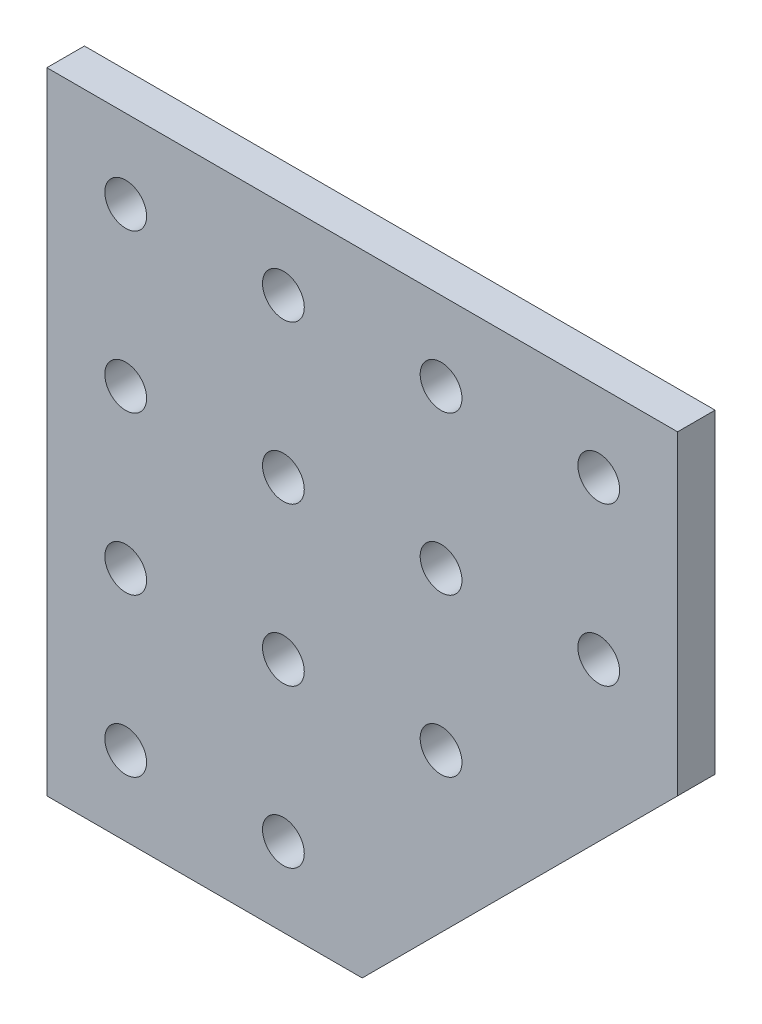
ISO-10303-21;
HEADER;
FILE_DESCRIPTION(('STEP AP214'),'2;1');
FILE_NAME('part.step','',(''),(''),'','','');
FILE_SCHEMA(('AUTOMOTIVE_DESIGN { 1 0 10303 214 1 1 1 1 }'));
ENDSEC;
DATA;
#1=APPLICATION_CONTEXT('core data for automotive mechanical design processes');
#2=APPLICATION_PROTOCOL_DEFINITION('international standard','automotive_design',2000,#1);
#3=PRODUCT_CONTEXT('',#1,'mechanical');
#4=PRODUCT('Part','Part','',(#3));
#5=PRODUCT_RELATED_PRODUCT_CATEGORY('part','',(#4));
#6=PRODUCT_DEFINITION_FORMATION('','',#4);
#7=PRODUCT_DEFINITION_CONTEXT('part definition',#1,'design');
#8=PRODUCT_DEFINITION('design','',#6,#7);
#9=PRODUCT_DEFINITION_SHAPE('','',#8);
#10=(LENGTH_UNIT() NAMED_UNIT(*) SI_UNIT(.MILLI.,.METRE.));
#11=(NAMED_UNIT(*) PLANE_ANGLE_UNIT() SI_UNIT($,.RADIAN.));
#12=(NAMED_UNIT(*) SI_UNIT($,.STERADIAN.) SOLID_ANGLE_UNIT());
#13=UNCERTAINTY_MEASURE_WITH_UNIT(LENGTH_MEASURE(1.E-05),#10,'distance_accuracy_value','');
#14=(GEOMETRIC_REPRESENTATION_CONTEXT(3) GLOBAL_UNCERTAINTY_ASSIGNED_CONTEXT((#13)) GLOBAL_UNIT_ASSIGNED_CONTEXT((#10,
#11,#12)) REPRESENTATION_CONTEXT('',''));
#15=CARTESIAN_POINT('',(0.,0.,0.));
#16=DIRECTION('',(0.,0.,1.));
#17=DIRECTION('',(1.,0.,0.));
#18=AXIS2_PLACEMENT_3D('',#15,#16,#17);
#19=CARTESIAN_POINT('',(0.,0.,4.7625));
#20=DIRECTION('',(0.,1.,0.));
#21=DIRECTION('',(0.,0.,1.));
#22=AXIS2_PLACEMENT_3D('',#19,#20,#21);
#23=PLANE('',#22);
#24=DIRECTION('',(1.,0.,0.));
#25=VECTOR('',#24,1.);
#26=CARTESIAN_POINT('',(0.,0.,0.));
#27=LINE('',#26,#25);
#28=CARTESIAN_POINT('',(0.,0.,0.));
#29=VERTEX_POINT('',#28);
#30=CARTESIAN_POINT('',(40.,0.,0.));
#31=VERTEX_POINT('',#30);
#32=EDGE_CURVE('E110',#29,#31,#27,.T.);
#33=ORIENTED_EDGE('',*,*,#32,.T.);
#34=DIRECTION('',(0.,0.,-1.));
#35=VECTOR('',#34,1.);
#36=CARTESIAN_POINT('',(40.,0.,4.7625));
#37=LINE('',#36,#35);
#38=CARTESIAN_POINT('',(40.,0.,4.7625));
#39=VERTEX_POINT('',#38);
#40=EDGE_CURVE('E11',#39,#31,#37,.T.);
#41=ORIENTED_EDGE('',*,*,#40,.F.);
#42=DIRECTION('',(1.,0.,0.));
#43=VECTOR('',#42,1.);
#44=CARTESIAN_POINT('',(0.,0.,4.7625));
#45=LINE('',#44,#43);
#46=CARTESIAN_POINT('',(0.,0.,4.7625));
#47=VERTEX_POINT('',#46);
#48=EDGE_CURVE('E121',#47,#39,#45,.T.);
#49=ORIENTED_EDGE('',*,*,#48,.F.);
#50=DIRECTION('',(0.,0.,-1.));
#51=VECTOR('',#50,1.);
#52=CARTESIAN_POINT('',(0.,0.,4.7625));
#53=LINE('',#52,#51);
#54=EDGE_CURVE('E51',#47,#29,#53,.T.);
#55=ORIENTED_EDGE('',*,*,#54,.T.);
#56=EDGE_LOOP('',(#33,#41,#49,#55));
#57=FACE_BOUND('',#56,.T.);
#58=ADVANCED_FACE('F35',(#57),#23,.F.);
#59=CARTESIAN_POINT('',(20.,-20.,4.7625));
#60=DIRECTION('',(-0.707106781186548,0.707106781186548,0.));
#61=DIRECTION('',(-0.707106781186548,-0.707106781186548,0.));
#62=AXIS2_PLACEMENT_3D('',#59,#60,#61);
#63=PLANE('',#62);
#64=DIRECTION('',(0.707106781186548,0.707106781186548,0.));
#65=VECTOR('',#64,1.);
#66=CARTESIAN_POINT('',(20.,-20.,0.));
#67=LINE('',#66,#65);
#68=CARTESIAN_POINT('',(80.,40.,0.));
#69=VERTEX_POINT('',#68);
#70=EDGE_CURVE('E112',#31,#69,#67,.T.);
#71=ORIENTED_EDGE('',*,*,#70,.T.);
#72=DIRECTION('',(0.,0.,-1.));
#73=VECTOR('',#72,1.);
#74=CARTESIAN_POINT('',(80.,40.,4.7625));
#75=LINE('',#74,#73);
#76=CARTESIAN_POINT('',(80.,40.,4.7625));
#77=VERTEX_POINT('',#76);
#78=EDGE_CURVE('E43',#77,#69,#75,.T.);
#79=ORIENTED_EDGE('',*,*,#78,.F.);
#80=DIRECTION('',(0.707106781186548,0.707106781186548,0.));
#81=VECTOR('',#80,1.);
#82=CARTESIAN_POINT('',(20.,-20.,4.7625));
#83=LINE('',#82,#81);
#84=EDGE_CURVE('E80',#39,#77,#83,.T.);
#85=ORIENTED_EDGE('',*,*,#84,.F.);
#86=ORIENTED_EDGE('',*,*,#40,.T.);
#87=EDGE_LOOP('',(#71,#79,#85,#86));
#88=FACE_BOUND('',#87,.T.);
#89=ADVANCED_FACE('F137',(#88),#63,.F.);
#90=CARTESIAN_POINT('',(80.,0.,4.7625));
#91=DIRECTION('',(-1.,0.,0.));
#92=DIRECTION('',(0.,0.,1.));
#93=AXIS2_PLACEMENT_3D('',#90,#91,#92);
#94=PLANE('',#93);
#95=DIRECTION('',(0.,1.,0.));
#96=VECTOR('',#95,1.);
#97=CARTESIAN_POINT('',(80.,0.,0.));
#98=LINE('',#97,#96);
#99=CARTESIAN_POINT('',(80.,80.,0.));
#100=VERTEX_POINT('',#99);
#101=EDGE_CURVE('E100',#69,#100,#98,.T.);
#102=ORIENTED_EDGE('',*,*,#101,.T.);
#103=DIRECTION('',(0.,0.,-1.));
#104=VECTOR('',#103,1.);
#105=CARTESIAN_POINT('',(80.,80.,4.7625));
#106=LINE('',#105,#104);
#107=CARTESIAN_POINT('',(80.,80.,4.7625));
#108=VERTEX_POINT('',#107);
#109=EDGE_CURVE('E97',#108,#100,#106,.T.);
#110=ORIENTED_EDGE('',*,*,#109,.F.);
#111=DIRECTION('',(0.,1.,0.));
#112=VECTOR('',#111,1.);
#113=CARTESIAN_POINT('',(80.,0.,4.7625));
#114=LINE('',#113,#112);
#115=EDGE_CURVE('E87',#77,#108,#114,.T.);
#116=ORIENTED_EDGE('',*,*,#115,.F.);
#117=ORIENTED_EDGE('',*,*,#78,.T.);
#118=EDGE_LOOP('',(#102,#110,#116,#117));
#119=FACE_BOUND('',#118,.T.);
#120=ADVANCED_FACE('F98',(#119),#94,.F.);
#121=CARTESIAN_POINT('',(0.,80.,4.7625));
#122=DIRECTION('',(0.,1.,0.));
#123=DIRECTION('',(0.,0.,1.));
#124=AXIS2_PLACEMENT_3D('',#121,#122,#123);
#125=PLANE('',#124);
#126=DIRECTION('',(1.,0.,0.));
#127=VECTOR('',#126,1.);
#128=CARTESIAN_POINT('',(0.,80.,0.));
#129=LINE('',#128,#127);
#130=CARTESIAN_POINT('',(0.,80.,0.));
#131=VERTEX_POINT('',#130);
#132=EDGE_CURVE('E116',#131,#100,#129,.T.);
#133=ORIENTED_EDGE('',*,*,#132,.F.);
#134=DIRECTION('',(0.,0.,-1.));
#135=VECTOR('',#134,1.);
#136=CARTESIAN_POINT('',(0.,80.,4.7625));
#137=LINE('',#136,#135);
#138=CARTESIAN_POINT('',(0.,80.,4.7625));
#139=VERTEX_POINT('',#138);
#140=EDGE_CURVE('E68',#139,#131,#137,.T.);
#141=ORIENTED_EDGE('',*,*,#140,.F.);
#142=DIRECTION('',(1.,0.,0.));
#143=VECTOR('',#142,1.);
#144=CARTESIAN_POINT('',(0.,80.,4.7625));
#145=LINE('',#144,#143);
#146=EDGE_CURVE('E92',#139,#108,#145,.T.);
#147=ORIENTED_EDGE('',*,*,#146,.T.);
#148=ORIENTED_EDGE('',*,*,#109,.T.);
#149=EDGE_LOOP('',(#133,#141,#147,#148));
#150=FACE_BOUND('',#149,.T.);
#151=ADVANCED_FACE('F104',(#150),#125,.T.);
#152=CARTESIAN_POINT('',(0.,0.,4.7625));
#153=DIRECTION('',(-1.,0.,0.));
#154=DIRECTION('',(0.,0.,1.));
#155=AXIS2_PLACEMENT_3D('',#152,#153,#154);
#156=PLANE('',#155);
#157=DIRECTION('',(0.,1.,0.));
#158=VECTOR('',#157,1.);
#159=CARTESIAN_POINT('',(0.,0.,0.));
#160=LINE('',#159,#158);
#161=EDGE_CURVE('E118',#29,#131,#160,.T.);
#162=ORIENTED_EDGE('',*,*,#161,.F.);
#163=ORIENTED_EDGE('',*,*,#54,.F.);
#164=DIRECTION('',(0.,1.,0.));
#165=VECTOR('',#164,1.);
#166=CARTESIAN_POINT('',(0.,0.,4.7625));
#167=LINE('',#166,#165);
#168=EDGE_CURVE('E105',#47,#139,#167,.T.);
#169=ORIENTED_EDGE('',*,*,#168,.T.);
#170=ORIENTED_EDGE('',*,*,#140,.T.);
#171=EDGE_LOOP('',(#162,#163,#169,#170));
#172=FACE_BOUND('',#171,.T.);
#173=ADVANCED_FACE('F125',(#172),#156,.T.);
#174=CARTESIAN_POINT('',(0.,0.,4.7625));
#175=DIRECTION('',(0.,0.,1.));
#176=DIRECTION('',(1.,0.,0.));
#177=AXIS2_PLACEMENT_3D('',#174,#175,#176);
#178=PLANE('',#177);
#179=CARTESIAN_POINT('',(10.,70.,4.7625));
#180=DIRECTION('',(0.,0.,1.));
#181=DIRECTION('',(1.,0.,0.));
#182=AXIS2_PLACEMENT_3D('',#179,#180,#181);
#183=CIRCLE('',#182,2.64999999999999);
#184=CARTESIAN_POINT('',(12.65,70.,4.7625));
#185=VERTEX_POINT('',#184);
#186=EDGE_CURVE('E218',#185,#185,#183,.T.);
#187=ORIENTED_EDGE('',*,*,#186,.F.);
#188=EDGE_LOOP('',(#187));
#189=FACE_BOUND('',#188,.T.);
#190=CARTESIAN_POINT('',(30.,70.,4.7625));
#191=DIRECTION('',(0.,0.,1.));
#192=DIRECTION('',(1.,0.,0.));
#193=AXIS2_PLACEMENT_3D('',#190,#191,#192);
#194=CIRCLE('',#193,2.64999999999999);
#195=CARTESIAN_POINT('',(32.65,70.,4.7625));
#196=VERTEX_POINT('',#195);
#197=EDGE_CURVE('E212',#196,#196,#194,.T.);
#198=ORIENTED_EDGE('',*,*,#197,.F.);
#199=EDGE_LOOP('',(#198));
#200=FACE_BOUND('',#199,.T.);
#201=CARTESIAN_POINT('',(50.,70.,4.7625));
#202=DIRECTION('',(0.,0.,1.));
#203=DIRECTION('',(1.,0.,0.));
#204=AXIS2_PLACEMENT_3D('',#201,#202,#203);
#205=CIRCLE('',#204,2.64999999999999);
#206=CARTESIAN_POINT('',(52.65,70.,4.7625));
#207=VERTEX_POINT('',#206);
#208=EDGE_CURVE('E206',#207,#207,#205,.T.);
#209=ORIENTED_EDGE('',*,*,#208,.F.);
#210=EDGE_LOOP('',(#209));
#211=FACE_BOUND('',#210,.T.);
#212=CARTESIAN_POINT('',(70.,70.,4.7625));
#213=DIRECTION('',(0.,0.,1.));
#214=DIRECTION('',(1.,0.,0.));
#215=AXIS2_PLACEMENT_3D('',#212,#213,#214);
#216=CIRCLE('',#215,2.64999999999999);
#217=CARTESIAN_POINT('',(72.65,70.,4.7625));
#218=VERTEX_POINT('',#217);
#219=EDGE_CURVE('E200',#218,#218,#216,.T.);
#220=ORIENTED_EDGE('',*,*,#219,.F.);
#221=EDGE_LOOP('',(#220));
#222=FACE_BOUND('',#221,.T.);
#223=CARTESIAN_POINT('',(30.0000000000002,50.,4.7625));
#224=DIRECTION('',(0.,0.,1.));
#225=DIRECTION('',(1.,0.,0.));
#226=AXIS2_PLACEMENT_3D('',#223,#224,#225);
#227=CIRCLE('',#226,2.64999999999999);
#228=CARTESIAN_POINT('',(32.6500000000002,50.,4.7625));
#229=VERTEX_POINT('',#228);
#230=EDGE_CURVE('E194',#229,#229,#227,.T.);
#231=ORIENTED_EDGE('',*,*,#230,.F.);
#232=EDGE_LOOP('',(#231));
#233=FACE_BOUND('',#232,.T.);
#234=CARTESIAN_POINT('',(50.0000000000002,50.,4.7625));
#235=DIRECTION('',(0.,0.,1.));
#236=DIRECTION('',(1.,0.,0.));
#237=AXIS2_PLACEMENT_3D('',#234,#235,#236);
#238=CIRCLE('',#237,2.64999999999999);
#239=CARTESIAN_POINT('',(52.6500000000002,50.,4.7625));
#240=VERTEX_POINT('',#239);
#241=EDGE_CURVE('E188',#240,#240,#238,.T.);
#242=ORIENTED_EDGE('',*,*,#241,.F.);
#243=EDGE_LOOP('',(#242));
#244=FACE_BOUND('',#243,.T.);
#245=CARTESIAN_POINT('',(70.0000000000002,50.,4.7625));
#246=DIRECTION('',(0.,0.,1.));
#247=DIRECTION('',(1.,0.,0.));
#248=AXIS2_PLACEMENT_3D('',#245,#246,#247);
#249=CIRCLE('',#248,2.64999999999999);
#250=CARTESIAN_POINT('',(72.6500000000002,50.,4.7625));
#251=VERTEX_POINT('',#250);
#252=EDGE_CURVE('E182',#251,#251,#249,.T.);
#253=ORIENTED_EDGE('',*,*,#252,.F.);
#254=EDGE_LOOP('',(#253));
#255=FACE_BOUND('',#254,.T.);
#256=CARTESIAN_POINT('',(30.0000000000004,30.,4.7625));
#257=DIRECTION('',(0.,0.,1.));
#258=DIRECTION('',(1.,0.,0.));
#259=AXIS2_PLACEMENT_3D('',#256,#257,#258);
#260=CIRCLE('',#259,2.64999999999999);
#261=CARTESIAN_POINT('',(32.6500000000004,30.,4.7625));
#262=VERTEX_POINT('',#261);
#263=EDGE_CURVE('E176',#262,#262,#260,.T.);
#264=ORIENTED_EDGE('',*,*,#263,.F.);
#265=EDGE_LOOP('',(#264));
#266=FACE_BOUND('',#265,.T.);
#267=CARTESIAN_POINT('',(50.0000000000004,30.,4.7625));
#268=DIRECTION('',(0.,0.,1.));
#269=DIRECTION('',(1.,0.,0.));
#270=AXIS2_PLACEMENT_3D('',#267,#268,#269);
#271=CIRCLE('',#270,2.64999999999999);
#272=CARTESIAN_POINT('',(52.6500000000004,30.,4.7625));
#273=VERTEX_POINT('',#272);
#274=EDGE_CURVE('E170',#273,#273,#271,.T.);
#275=ORIENTED_EDGE('',*,*,#274,.F.);
#276=EDGE_LOOP('',(#275));
#277=FACE_BOUND('',#276,.T.);
#278=CARTESIAN_POINT('',(30.0000000000006,10.,4.7625));
#279=DIRECTION('',(0.,0.,1.));
#280=DIRECTION('',(1.,0.,0.));
#281=AXIS2_PLACEMENT_3D('',#278,#279,#280);
#282=CIRCLE('',#281,2.64999999999999);
#283=CARTESIAN_POINT('',(32.6500000000006,10.,4.7625));
#284=VERTEX_POINT('',#283);
#285=EDGE_CURVE('E164',#284,#284,#282,.T.);
#286=ORIENTED_EDGE('',*,*,#285,.F.);
#287=EDGE_LOOP('',(#286));
#288=FACE_BOUND('',#287,.T.);
#289=CARTESIAN_POINT('',(10.0000000000002,50.,4.7625));
#290=DIRECTION('',(0.,0.,1.));
#291=DIRECTION('',(1.,0.,0.));
#292=AXIS2_PLACEMENT_3D('',#289,#290,#291);
#293=CIRCLE('',#292,2.64999999999999);
#294=CARTESIAN_POINT('',(12.6500000000002,50.,4.7625));
#295=VERTEX_POINT('',#294);
#296=EDGE_CURVE('E158',#295,#295,#293,.T.);
#297=ORIENTED_EDGE('',*,*,#296,.F.);
#298=EDGE_LOOP('',(#297));
#299=FACE_BOUND('',#298,.T.);
#300=CARTESIAN_POINT('',(10.0000000000004,30.,4.7625));
#301=DIRECTION('',(0.,0.,1.));
#302=DIRECTION('',(1.,0.,0.));
#303=AXIS2_PLACEMENT_3D('',#300,#301,#302);
#304=CIRCLE('',#303,2.64999999999999);
#305=CARTESIAN_POINT('',(12.6500000000004,30.,4.7625));
#306=VERTEX_POINT('',#305);
#307=EDGE_CURVE('E152',#306,#306,#304,.T.);
#308=ORIENTED_EDGE('',*,*,#307,.F.);
#309=EDGE_LOOP('',(#308));
#310=FACE_BOUND('',#309,.T.);
#311=CARTESIAN_POINT('',(10.0000000000006,10.,4.7625));
#312=DIRECTION('',(0.,0.,1.));
#313=DIRECTION('',(1.,0.,0.));
#314=AXIS2_PLACEMENT_3D('',#311,#312,#313);
#315=CIRCLE('',#314,2.64999999999999);
#316=CARTESIAN_POINT('',(12.6500000000006,10.,4.7625));
#317=VERTEX_POINT('',#316);
#318=EDGE_CURVE('E146',#317,#317,#315,.T.);
#319=ORIENTED_EDGE('',*,*,#318,.F.);
#320=EDGE_LOOP('',(#319));
#321=FACE_BOUND('',#320,.T.);
#322=ORIENTED_EDGE('',*,*,#48,.T.);
#323=ORIENTED_EDGE('',*,*,#84,.T.);
#324=ORIENTED_EDGE('',*,*,#115,.T.);
#325=ORIENTED_EDGE('',*,*,#146,.F.);
#326=ORIENTED_EDGE('',*,*,#168,.F.);
#327=EDGE_LOOP('',(#322,#323,#324,#325,#326));
#328=FACE_BOUND('',#327,.T.);
#329=ADVANCED_FACE('F89',(#189,#200,#211,#222,#233,#244,#255,#266,#277,#288,#299,#310,#321,
#328),#178,.T.);
#330=CARTESIAN_POINT('',(0.,0.,0.));
#331=DIRECTION('',(0.,0.,1.));
#332=DIRECTION('',(1.,0.,0.));
#333=AXIS2_PLACEMENT_3D('',#330,#331,#332);
#334=PLANE('',#333);
#335=CARTESIAN_POINT('',(10.,70.,0.));
#336=DIRECTION('',(0.,0.,1.));
#337=DIRECTION('',(1.,0.,0.));
#338=AXIS2_PLACEMENT_3D('',#335,#336,#337);
#339=CIRCLE('',#338,2.65);
#340=CARTESIAN_POINT('',(12.65,70.,0.));
#341=VERTEX_POINT('',#340);
#342=EDGE_CURVE('E215',#341,#341,#339,.T.);
#343=ORIENTED_EDGE('',*,*,#342,.T.);
#344=EDGE_LOOP('',(#343));
#345=FACE_BOUND('',#344,.T.);
#346=CARTESIAN_POINT('',(30.,70.,0.));
#347=DIRECTION('',(0.,0.,1.));
#348=DIRECTION('',(1.,0.,0.));
#349=AXIS2_PLACEMENT_3D('',#346,#347,#348);
#350=CIRCLE('',#349,2.65);
#351=CARTESIAN_POINT('',(32.65,70.,0.));
#352=VERTEX_POINT('',#351);
#353=EDGE_CURVE('E209',#352,#352,#350,.T.);
#354=ORIENTED_EDGE('',*,*,#353,.T.);
#355=EDGE_LOOP('',(#354));
#356=FACE_BOUND('',#355,.T.);
#357=CARTESIAN_POINT('',(50.,70.,0.));
#358=DIRECTION('',(0.,0.,1.));
#359=DIRECTION('',(1.,0.,0.));
#360=AXIS2_PLACEMENT_3D('',#357,#358,#359);
#361=CIRCLE('',#360,2.65);
#362=CARTESIAN_POINT('',(52.65,70.,0.));
#363=VERTEX_POINT('',#362);
#364=EDGE_CURVE('E203',#363,#363,#361,.T.);
#365=ORIENTED_EDGE('',*,*,#364,.T.);
#366=EDGE_LOOP('',(#365));
#367=FACE_BOUND('',#366,.T.);
#368=CARTESIAN_POINT('',(70.,70.,0.));
#369=DIRECTION('',(0.,0.,1.));
#370=DIRECTION('',(1.,0.,0.));
#371=AXIS2_PLACEMENT_3D('',#368,#369,#370);
#372=CIRCLE('',#371,2.65);
#373=CARTESIAN_POINT('',(72.65,70.,0.));
#374=VERTEX_POINT('',#373);
#375=EDGE_CURVE('E197',#374,#374,#372,.T.);
#376=ORIENTED_EDGE('',*,*,#375,.T.);
#377=EDGE_LOOP('',(#376));
#378=FACE_BOUND('',#377,.T.);
#379=CARTESIAN_POINT('',(30.0000000000002,50.,0.));
#380=DIRECTION('',(0.,0.,1.));
#381=DIRECTION('',(1.,0.,0.));
#382=AXIS2_PLACEMENT_3D('',#379,#380,#381);
#383=CIRCLE('',#382,2.65);
#384=CARTESIAN_POINT('',(32.6500000000002,50.,0.));
#385=VERTEX_POINT('',#384);
#386=EDGE_CURVE('E191',#385,#385,#383,.T.);
#387=ORIENTED_EDGE('',*,*,#386,.T.);
#388=EDGE_LOOP('',(#387));
#389=FACE_BOUND('',#388,.T.);
#390=CARTESIAN_POINT('',(50.0000000000002,50.,0.));
#391=DIRECTION('',(0.,0.,1.));
#392=DIRECTION('',(1.,0.,0.));
#393=AXIS2_PLACEMENT_3D('',#390,#391,#392);
#394=CIRCLE('',#393,2.65);
#395=CARTESIAN_POINT('',(52.6500000000002,50.,0.));
#396=VERTEX_POINT('',#395);
#397=EDGE_CURVE('E185',#396,#396,#394,.T.);
#398=ORIENTED_EDGE('',*,*,#397,.T.);
#399=EDGE_LOOP('',(#398));
#400=FACE_BOUND('',#399,.T.);
#401=CARTESIAN_POINT('',(70.0000000000002,50.,0.));
#402=DIRECTION('',(0.,0.,1.));
#403=DIRECTION('',(1.,0.,0.));
#404=AXIS2_PLACEMENT_3D('',#401,#402,#403);
#405=CIRCLE('',#404,2.65);
#406=CARTESIAN_POINT('',(72.6500000000002,50.,0.));
#407=VERTEX_POINT('',#406);
#408=EDGE_CURVE('E179',#407,#407,#405,.T.);
#409=ORIENTED_EDGE('',*,*,#408,.T.);
#410=EDGE_LOOP('',(#409));
#411=FACE_BOUND('',#410,.T.);
#412=CARTESIAN_POINT('',(30.0000000000004,30.,0.));
#413=DIRECTION('',(0.,0.,1.));
#414=DIRECTION('',(1.,0.,0.));
#415=AXIS2_PLACEMENT_3D('',#412,#413,#414);
#416=CIRCLE('',#415,2.65);
#417=CARTESIAN_POINT('',(32.6500000000004,30.,0.));
#418=VERTEX_POINT('',#417);
#419=EDGE_CURVE('E173',#418,#418,#416,.T.);
#420=ORIENTED_EDGE('',*,*,#419,.T.);
#421=EDGE_LOOP('',(#420));
#422=FACE_BOUND('',#421,.T.);
#423=CARTESIAN_POINT('',(50.0000000000004,30.,0.));
#424=DIRECTION('',(0.,0.,1.));
#425=DIRECTION('',(1.,0.,0.));
#426=AXIS2_PLACEMENT_3D('',#423,#424,#425);
#427=CIRCLE('',#426,2.65);
#428=CARTESIAN_POINT('',(52.6500000000004,30.,0.));
#429=VERTEX_POINT('',#428);
#430=EDGE_CURVE('E167',#429,#429,#427,.T.);
#431=ORIENTED_EDGE('',*,*,#430,.T.);
#432=EDGE_LOOP('',(#431));
#433=FACE_BOUND('',#432,.T.);
#434=CARTESIAN_POINT('',(30.0000000000006,10.,0.));
#435=DIRECTION('',(0.,0.,1.));
#436=DIRECTION('',(1.,0.,0.));
#437=AXIS2_PLACEMENT_3D('',#434,#435,#436);
#438=CIRCLE('',#437,2.65);
#439=CARTESIAN_POINT('',(32.6500000000006,10.,0.));
#440=VERTEX_POINT('',#439);
#441=EDGE_CURVE('E161',#440,#440,#438,.T.);
#442=ORIENTED_EDGE('',*,*,#441,.T.);
#443=EDGE_LOOP('',(#442));
#444=FACE_BOUND('',#443,.T.);
#445=CARTESIAN_POINT('',(10.0000000000002,50.,0.));
#446=DIRECTION('',(0.,0.,1.));
#447=DIRECTION('',(1.,0.,0.));
#448=AXIS2_PLACEMENT_3D('',#445,#446,#447);
#449=CIRCLE('',#448,2.65);
#450=CARTESIAN_POINT('',(12.6500000000002,50.,0.));
#451=VERTEX_POINT('',#450);
#452=EDGE_CURVE('E155',#451,#451,#449,.T.);
#453=ORIENTED_EDGE('',*,*,#452,.T.);
#454=EDGE_LOOP('',(#453));
#455=FACE_BOUND('',#454,.T.);
#456=CARTESIAN_POINT('',(10.0000000000004,30.,0.));
#457=DIRECTION('',(0.,0.,1.));
#458=DIRECTION('',(1.,0.,0.));
#459=AXIS2_PLACEMENT_3D('',#456,#457,#458);
#460=CIRCLE('',#459,2.65);
#461=CARTESIAN_POINT('',(12.6500000000004,30.,0.));
#462=VERTEX_POINT('',#461);
#463=EDGE_CURVE('E149',#462,#462,#460,.T.);
#464=ORIENTED_EDGE('',*,*,#463,.T.);
#465=EDGE_LOOP('',(#464));
#466=FACE_BOUND('',#465,.T.);
#467=CARTESIAN_POINT('',(10.0000000000006,10.,0.));
#468=DIRECTION('',(0.,0.,1.));
#469=DIRECTION('',(1.,0.,0.));
#470=AXIS2_PLACEMENT_3D('',#467,#468,#469);
#471=CIRCLE('',#470,2.65);
#472=CARTESIAN_POINT('',(12.6500000000006,10.,0.));
#473=VERTEX_POINT('',#472);
#474=EDGE_CURVE('E113',#473,#473,#471,.T.);
#475=ORIENTED_EDGE('',*,*,#474,.T.);
#476=EDGE_LOOP('',(#475));
#477=FACE_BOUND('',#476,.T.);
#478=ORIENTED_EDGE('',*,*,#32,.F.);
#479=ORIENTED_EDGE('',*,*,#161,.T.);
#480=ORIENTED_EDGE('',*,*,#132,.T.);
#481=ORIENTED_EDGE('',*,*,#101,.F.);
#482=ORIENTED_EDGE('',*,*,#70,.F.);
#483=EDGE_LOOP('',(#478,#479,#480,#481,#482));
#484=FACE_BOUND('',#483,.T.);
#485=ADVANCED_FACE('F124',(#345,#356,#367,#378,#389,#400,#411,#422,#433,#444,#455,#466,#477,
#484),#334,.F.);
#486=CARTESIAN_POINT('',(10.0000000000006,10.,4.7625));
#487=DIRECTION('',(0.,0.,1.));
#488=DIRECTION('',(1.,0.,0.));
#489=AXIS2_PLACEMENT_3D('',#486,#487,#488);
#490=CYLINDRICAL_SURFACE('',#489,2.64999999999999);
#491=ORIENTED_EDGE('',*,*,#474,.F.);
#492=EDGE_LOOP('',(#491));
#493=FACE_BOUND('',#492,.T.);
#494=ORIENTED_EDGE('',*,*,#318,.T.);
#495=EDGE_LOOP('',(#494));
#496=FACE_BOUND('',#495,.T.);
#497=ADVANCED_FACE('F248',(#493,#496),#490,.F.);
#498=CARTESIAN_POINT('',(10.0000000000004,30.,4.7625));
#499=DIRECTION('',(0.,0.,1.));
#500=DIRECTION('',(1.,0.,0.));
#501=AXIS2_PLACEMENT_3D('',#498,#499,#500);
#502=CYLINDRICAL_SURFACE('',#501,2.64999999999999);
#503=ORIENTED_EDGE('',*,*,#463,.F.);
#504=EDGE_LOOP('',(#503));
#505=FACE_BOUND('',#504,.T.);
#506=ORIENTED_EDGE('',*,*,#307,.T.);
#507=EDGE_LOOP('',(#506));
#508=FACE_BOUND('',#507,.T.);
#509=ADVANCED_FACE('F250',(#505,#508),#502,.F.);
#510=CARTESIAN_POINT('',(10.0000000000002,50.,4.7625));
#511=DIRECTION('',(0.,0.,1.));
#512=DIRECTION('',(1.,0.,0.));
#513=AXIS2_PLACEMENT_3D('',#510,#511,#512);
#514=CYLINDRICAL_SURFACE('',#513,2.64999999999999);
#515=ORIENTED_EDGE('',*,*,#452,.F.);
#516=EDGE_LOOP('',(#515));
#517=FACE_BOUND('',#516,.T.);
#518=ORIENTED_EDGE('',*,*,#296,.T.);
#519=EDGE_LOOP('',(#518));
#520=FACE_BOUND('',#519,.T.);
#521=ADVANCED_FACE('F257',(#517,#520),#514,.F.);
#522=CARTESIAN_POINT('',(30.0000000000006,10.,4.7625));
#523=DIRECTION('',(0.,0.,1.));
#524=DIRECTION('',(1.,0.,0.));
#525=AXIS2_PLACEMENT_3D('',#522,#523,#524);
#526=CYLINDRICAL_SURFACE('',#525,2.64999999999999);
#527=ORIENTED_EDGE('',*,*,#441,.F.);
#528=EDGE_LOOP('',(#527));
#529=FACE_BOUND('',#528,.T.);
#530=ORIENTED_EDGE('',*,*,#285,.T.);
#531=EDGE_LOOP('',(#530));
#532=FACE_BOUND('',#531,.T.);
#533=ADVANCED_FACE('F265',(#529,#532),#526,.F.);
#534=CARTESIAN_POINT('',(50.0000000000004,30.,4.7625));
#535=DIRECTION('',(0.,0.,1.));
#536=DIRECTION('',(1.,0.,0.));
#537=AXIS2_PLACEMENT_3D('',#534,#535,#536);
#538=CYLINDRICAL_SURFACE('',#537,2.64999999999999);
#539=ORIENTED_EDGE('',*,*,#430,.F.);
#540=EDGE_LOOP('',(#539));
#541=FACE_BOUND('',#540,.T.);
#542=ORIENTED_EDGE('',*,*,#274,.T.);
#543=EDGE_LOOP('',(#542));
#544=FACE_BOUND('',#543,.T.);
#545=ADVANCED_FACE('F269',(#541,#544),#538,.F.);
#546=CARTESIAN_POINT('',(30.0000000000004,30.,4.7625));
#547=DIRECTION('',(0.,0.,1.));
#548=DIRECTION('',(1.,0.,0.));
#549=AXIS2_PLACEMENT_3D('',#546,#547,#548);
#550=CYLINDRICAL_SURFACE('',#549,2.64999999999999);
#551=ORIENTED_EDGE('',*,*,#419,.F.);
#552=EDGE_LOOP('',(#551));
#553=FACE_BOUND('',#552,.T.);
#554=ORIENTED_EDGE('',*,*,#263,.T.);
#555=EDGE_LOOP('',(#554));
#556=FACE_BOUND('',#555,.T.);
#557=ADVANCED_FACE('F273',(#553,#556),#550,.F.);
#558=CARTESIAN_POINT('',(70.0000000000002,50.,4.7625));
#559=DIRECTION('',(0.,0.,1.));
#560=DIRECTION('',(1.,0.,0.));
#561=AXIS2_PLACEMENT_3D('',#558,#559,#560);
#562=CYLINDRICAL_SURFACE('',#561,2.64999999999999);
#563=ORIENTED_EDGE('',*,*,#408,.F.);
#564=EDGE_LOOP('',(#563));
#565=FACE_BOUND('',#564,.T.);
#566=ORIENTED_EDGE('',*,*,#252,.T.);
#567=EDGE_LOOP('',(#566));
#568=FACE_BOUND('',#567,.T.);
#569=ADVANCED_FACE('F277',(#565,#568),#562,.F.);
#570=CARTESIAN_POINT('',(50.0000000000002,50.,4.7625));
#571=DIRECTION('',(0.,0.,1.));
#572=DIRECTION('',(1.,0.,0.));
#573=AXIS2_PLACEMENT_3D('',#570,#571,#572);
#574=CYLINDRICAL_SURFACE('',#573,2.64999999999999);
#575=ORIENTED_EDGE('',*,*,#397,.F.);
#576=EDGE_LOOP('',(#575));
#577=FACE_BOUND('',#576,.T.);
#578=ORIENTED_EDGE('',*,*,#241,.T.);
#579=EDGE_LOOP('',(#578));
#580=FACE_BOUND('',#579,.T.);
#581=ADVANCED_FACE('F281',(#577,#580),#574,.F.);
#582=CARTESIAN_POINT('',(30.0000000000002,50.,4.7625));
#583=DIRECTION('',(0.,0.,1.));
#584=DIRECTION('',(1.,0.,0.));
#585=AXIS2_PLACEMENT_3D('',#582,#583,#584);
#586=CYLINDRICAL_SURFACE('',#585,2.64999999999999);
#587=ORIENTED_EDGE('',*,*,#386,.F.);
#588=EDGE_LOOP('',(#587));
#589=FACE_BOUND('',#588,.T.);
#590=ORIENTED_EDGE('',*,*,#230,.T.);
#591=EDGE_LOOP('',(#590));
#592=FACE_BOUND('',#591,.T.);
#593=ADVANCED_FACE('F285',(#589,#592),#586,.F.);
#594=CARTESIAN_POINT('',(70.,70.,4.7625));
#595=DIRECTION('',(0.,0.,1.));
#596=DIRECTION('',(1.,0.,0.));
#597=AXIS2_PLACEMENT_3D('',#594,#595,#596);
#598=CYLINDRICAL_SURFACE('',#597,2.64999999999999);
#599=ORIENTED_EDGE('',*,*,#375,.F.);
#600=EDGE_LOOP('',(#599));
#601=FACE_BOUND('',#600,.T.);
#602=ORIENTED_EDGE('',*,*,#219,.T.);
#603=EDGE_LOOP('',(#602));
#604=FACE_BOUND('',#603,.T.);
#605=ADVANCED_FACE('F289',(#601,#604),#598,.F.);
#606=CARTESIAN_POINT('',(50.,70.,4.7625));
#607=DIRECTION('',(0.,0.,1.));
#608=DIRECTION('',(1.,0.,0.));
#609=AXIS2_PLACEMENT_3D('',#606,#607,#608);
#610=CYLINDRICAL_SURFACE('',#609,2.64999999999999);
#611=ORIENTED_EDGE('',*,*,#364,.F.);
#612=EDGE_LOOP('',(#611));
#613=FACE_BOUND('',#612,.T.);
#614=ORIENTED_EDGE('',*,*,#208,.T.);
#615=EDGE_LOOP('',(#614));
#616=FACE_BOUND('',#615,.T.);
#617=ADVANCED_FACE('F293',(#613,#616),#610,.F.);
#618=CARTESIAN_POINT('',(30.,70.,4.7625));
#619=DIRECTION('',(0.,0.,1.));
#620=DIRECTION('',(1.,0.,0.));
#621=AXIS2_PLACEMENT_3D('',#618,#619,#620);
#622=CYLINDRICAL_SURFACE('',#621,2.64999999999999);
#623=ORIENTED_EDGE('',*,*,#353,.F.);
#624=EDGE_LOOP('',(#623));
#625=FACE_BOUND('',#624,.T.);
#626=ORIENTED_EDGE('',*,*,#197,.T.);
#627=EDGE_LOOP('',(#626));
#628=FACE_BOUND('',#627,.T.);
#629=ADVANCED_FACE('F297',(#625,#628),#622,.F.);
#630=CARTESIAN_POINT('',(10.,70.,4.7625));
#631=DIRECTION('',(0.,0.,1.));
#632=DIRECTION('',(1.,0.,0.));
#633=AXIS2_PLACEMENT_3D('',#630,#631,#632);
#634=CYLINDRICAL_SURFACE('',#633,2.64999999999999);
#635=ORIENTED_EDGE('',*,*,#342,.F.);
#636=EDGE_LOOP('',(#635));
#637=FACE_BOUND('',#636,.T.);
#638=ORIENTED_EDGE('',*,*,#186,.T.);
#639=EDGE_LOOP('',(#638));
#640=FACE_BOUND('',#639,.T.);
#641=ADVANCED_FACE('F222',(#637,#640),#634,.F.);
#642=CLOSED_SHELL('',(#58,#89,#120,#151,#173,#329,#485,#497,#509,#521,#533,#545,#557,#569,#581,
#593,#605,#617,#629,#641));
#643=MANIFOLD_SOLID_BREP('B2',#642);
#644=ADVANCED_BREP_SHAPE_REPRESENTATION('',(#18,#643),#14);
#645=SHAPE_DEFINITION_REPRESENTATION(#9,#644);
ENDSEC;
END-ISO-10303-21;
